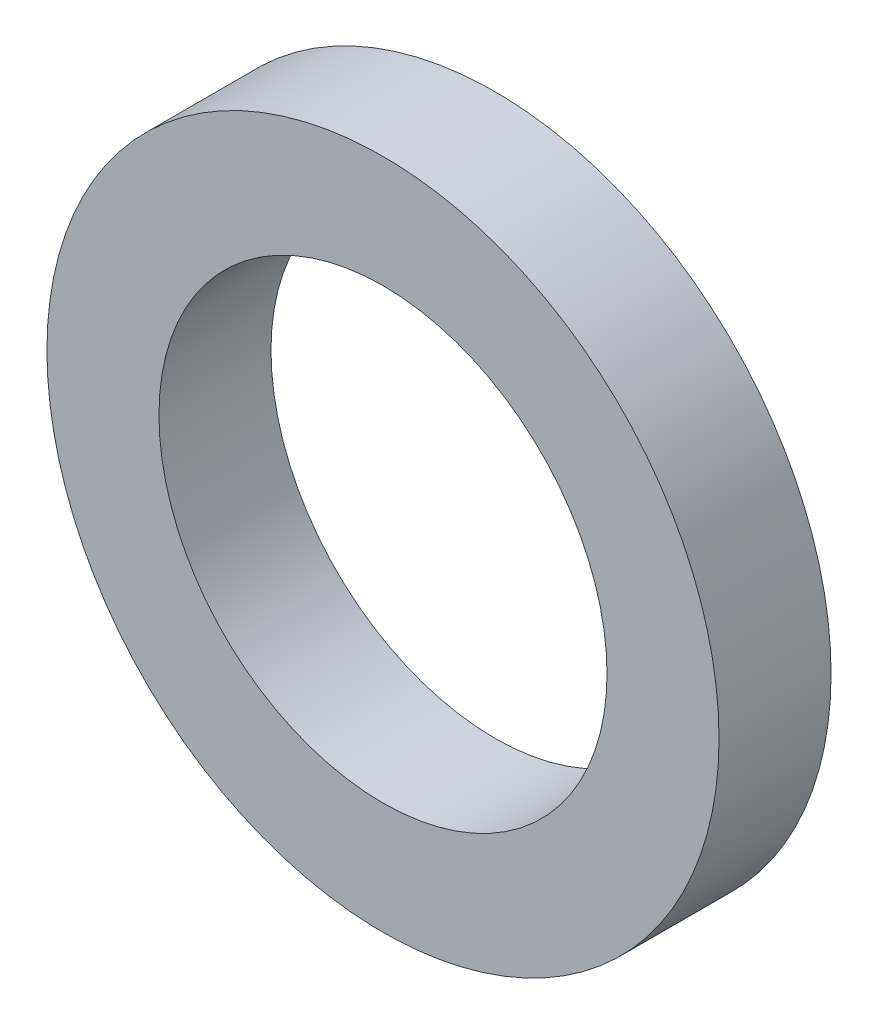
ISO-10303-21;
HEADER;
FILE_DESCRIPTION(('STEP AP214'),'2;1');
FILE_NAME('part.step','',(''),(''),'','','');
FILE_SCHEMA(('AUTOMOTIVE_DESIGN { 1 0 10303 214 1 1 1 1 }'));
ENDSEC;
DATA;
#1=APPLICATION_CONTEXT('core data for automotive mechanical design processes');
#2=APPLICATION_PROTOCOL_DEFINITION('international standard','automotive_design',2000,#1);
#3=PRODUCT_CONTEXT('',#1,'mechanical');
#4=PRODUCT('Part','Part','',(#3));
#5=PRODUCT_RELATED_PRODUCT_CATEGORY('part','',(#4));
#6=PRODUCT_DEFINITION_FORMATION('','',#4);
#7=PRODUCT_DEFINITION_CONTEXT('part definition',#1,'design');
#8=PRODUCT_DEFINITION('design','',#6,#7);
#9=PRODUCT_DEFINITION_SHAPE('','',#8);
#10=(LENGTH_UNIT() NAMED_UNIT(*) SI_UNIT(.MILLI.,.METRE.));
#11=(NAMED_UNIT(*) PLANE_ANGLE_UNIT() SI_UNIT($,.RADIAN.));
#12=(NAMED_UNIT(*) SI_UNIT($,.STERADIAN.) SOLID_ANGLE_UNIT());
#13=UNCERTAINTY_MEASURE_WITH_UNIT(LENGTH_MEASURE(1.E-05),#10,'distance_accuracy_value','');
#14=(GEOMETRIC_REPRESENTATION_CONTEXT(3) GLOBAL_UNCERTAINTY_ASSIGNED_CONTEXT((#13)) GLOBAL_UNIT_ASSIGNED_CONTEXT((#10,
#11,#12)) REPRESENTATION_CONTEXT('',''));
#15=CARTESIAN_POINT('',(0.,0.,0.));
#16=DIRECTION('',(0.,0.,1.));
#17=DIRECTION('',(1.,0.,0.));
#18=AXIS2_PLACEMENT_3D('',#15,#16,#17);
#19=CARTESIAN_POINT('',(0.,0.,2.));
#20=DIRECTION('',(0.,0.,1.));
#21=DIRECTION('',(1.,0.,0.));
#22=AXIS2_PLACEMENT_3D('',#19,#20,#21);
#23=PLANE('',#22);
#24=CARTESIAN_POINT('',(0.,0.,2.));
#25=DIRECTION('',(0.,0.,1.));
#26=DIRECTION('',(1.,0.,0.));
#27=AXIS2_PLACEMENT_3D('',#24,#25,#26);
#28=CIRCLE('',#27,6.);
#29=CARTESIAN_POINT('',(6.,0.,2.));
#30=VERTEX_POINT('',#29);
#31=EDGE_CURVE('E10',#30,#30,#28,.T.);
#32=ORIENTED_EDGE('',*,*,#31,.T.);
#33=EDGE_LOOP('',(#32));
#34=FACE_BOUND('',#33,.T.);
#35=CARTESIAN_POINT('',(0.,0.,2.));
#36=DIRECTION('',(0.,0.,1.));
#37=DIRECTION('',(1.,0.,0.));
#38=AXIS2_PLACEMENT_3D('',#35,#36,#37);
#39=CIRCLE('',#38,4.);
#40=CARTESIAN_POINT('',(4.,0.,2.));
#41=VERTEX_POINT('',#40);
#42=EDGE_CURVE('E40',#41,#41,#39,.T.);
#43=ORIENTED_EDGE('',*,*,#42,.F.);
#44=EDGE_LOOP('',(#43));
#45=FACE_BOUND('',#44,.T.);
#46=ADVANCED_FACE('F29',(#34,#45),#23,.T.);
#47=CARTESIAN_POINT('',(0.,0.,0.));
#48=DIRECTION('',(0.,0.,1.));
#49=DIRECTION('',(1.,0.,0.));
#50=AXIS2_PLACEMENT_3D('',#47,#48,#49);
#51=PLANE('',#50);
#52=CARTESIAN_POINT('',(0.,0.,0.));
#53=DIRECTION('',(0.,0.,1.));
#54=DIRECTION('',(1.,0.,0.));
#55=AXIS2_PLACEMENT_3D('',#52,#53,#54);
#56=CIRCLE('',#55,6.);
#57=CARTESIAN_POINT('',(6.,0.,0.));
#58=VERTEX_POINT('',#57);
#59=EDGE_CURVE('E33',#58,#58,#56,.T.);
#60=ORIENTED_EDGE('',*,*,#59,.F.);
#61=EDGE_LOOP('',(#60));
#62=FACE_BOUND('',#61,.T.);
#63=CARTESIAN_POINT('',(0.,0.,0.));
#64=DIRECTION('',(0.,0.,1.));
#65=DIRECTION('',(1.,0.,0.));
#66=AXIS2_PLACEMENT_3D('',#63,#64,#65);
#67=CIRCLE('',#66,4.);
#68=CARTESIAN_POINT('',(4.,0.,0.));
#69=VERTEX_POINT('',#68);
#70=EDGE_CURVE('E42',#69,#69,#67,.T.);
#71=ORIENTED_EDGE('',*,*,#70,.T.);
#72=EDGE_LOOP('',(#71));
#73=FACE_BOUND('',#72,.T.);
#74=ADVANCED_FACE('F52',(#62,#73),#51,.F.);
#75=CARTESIAN_POINT('',(0.,0.,2.));
#76=DIRECTION('',(0.,0.,-1.));
#77=DIRECTION('',(-1.,0.,0.));
#78=AXIS2_PLACEMENT_3D('',#75,#76,#77);
#79=CYLINDRICAL_SURFACE('',#78,6.);
#80=ORIENTED_EDGE('',*,*,#31,.F.);
#81=EDGE_LOOP('',(#80));
#82=FACE_BOUND('',#81,.T.);
#83=ORIENTED_EDGE('',*,*,#59,.T.);
#84=EDGE_LOOP('',(#83));
#85=FACE_BOUND('',#84,.T.);
#86=ADVANCED_FACE('F31',(#82,#85),#79,.T.);
#87=CARTESIAN_POINT('',(0.,0.,2.));
#88=DIRECTION('',(0.,0.,-1.));
#89=DIRECTION('',(-1.,0.,0.));
#90=AXIS2_PLACEMENT_3D('',#87,#88,#89);
#91=CYLINDRICAL_SURFACE('',#90,4.);
#92=ORIENTED_EDGE('',*,*,#42,.T.);
#93=EDGE_LOOP('',(#92));
#94=FACE_BOUND('',#93,.T.);
#95=ORIENTED_EDGE('',*,*,#70,.F.);
#96=EDGE_LOOP('',(#95));
#97=FACE_BOUND('',#96,.T.);
#98=ADVANCED_FACE('F48',(#94,#97),#91,.F.);
#99=CLOSED_SHELL('',(#46,#74,#86,#98));
#100=MANIFOLD_SOLID_BREP('B2',#99);
#101=ADVANCED_BREP_SHAPE_REPRESENTATION('',(#18,#100),#14);
#102=SHAPE_DEFINITION_REPRESENTATION(#9,#101);
ENDSEC;
END-ISO-10303-21;
